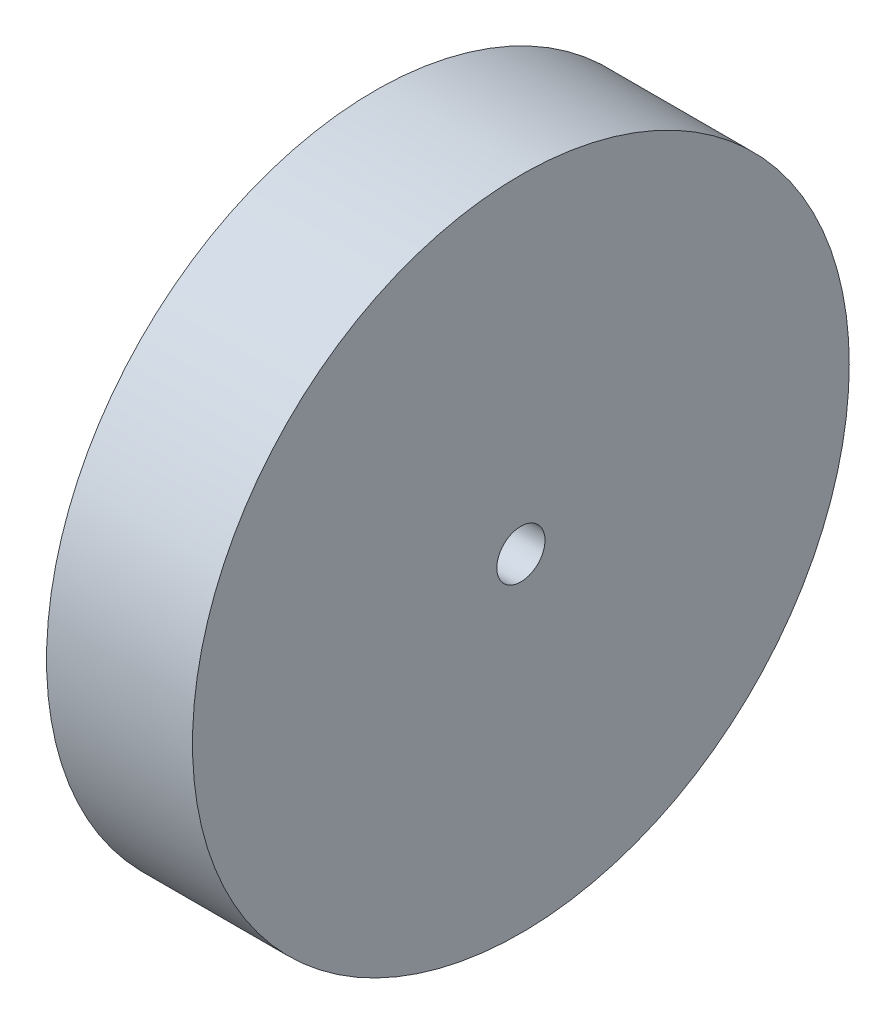
ISO-10303-21;
HEADER;
FILE_DESCRIPTION(('STEP AP214'),'2;1');
FILE_NAME('part.step','',(''),(''),'','','');
FILE_SCHEMA(('AUTOMOTIVE_DESIGN { 1 0 10303 214 1 1 1 1 }'));
ENDSEC;
DATA;
#1=APPLICATION_CONTEXT('core data for automotive mechanical design processes');
#2=APPLICATION_PROTOCOL_DEFINITION('international standard','automotive_design',2000,#1);
#3=PRODUCT_CONTEXT('',#1,'mechanical');
#4=PRODUCT('Part','Part','',(#3));
#5=PRODUCT_RELATED_PRODUCT_CATEGORY('part','',(#4));
#6=PRODUCT_DEFINITION_FORMATION('','',#4);
#7=PRODUCT_DEFINITION_CONTEXT('part definition',#1,'design');
#8=PRODUCT_DEFINITION('design','',#6,#7);
#9=PRODUCT_DEFINITION_SHAPE('','',#8);
#10=(LENGTH_UNIT() NAMED_UNIT(*) SI_UNIT(.MILLI.,.METRE.));
#11=(NAMED_UNIT(*) PLANE_ANGLE_UNIT() SI_UNIT($,.RADIAN.));
#12=(NAMED_UNIT(*) SI_UNIT($,.STERADIAN.) SOLID_ANGLE_UNIT());
#13=UNCERTAINTY_MEASURE_WITH_UNIT(LENGTH_MEASURE(1.E-05),#10,'distance_accuracy_value','');
#14=(GEOMETRIC_REPRESENTATION_CONTEXT(3) GLOBAL_UNCERTAINTY_ASSIGNED_CONTEXT((#13)) GLOBAL_UNIT_ASSIGNED_CONTEXT((#10,
#11,#12)) REPRESENTATION_CONTEXT('',''));
#15=CARTESIAN_POINT('',(0.,0.,0.));
#16=DIRECTION('',(0.,0.,1.));
#17=DIRECTION('',(1.,0.,0.));
#18=AXIS2_PLACEMENT_3D('',#15,#16,#17);
#19=CARTESIAN_POINT('',(16.9333333333333,0.,0.));
#20=DIRECTION('',(-1.,0.,0.));
#21=DIRECTION('',(0.,0.,1.));
#22=AXIS2_PLACEMENT_3D('',#19,#20,#21);
#23=CYLINDRICAL_SURFACE('',#22,38.1);
#24=CARTESIAN_POINT('',(16.9333333333333,0.,0.));
#25=DIRECTION('',(1.,0.,0.));
#26=DIRECTION('',(0.,0.,-1.));
#27=AXIS2_PLACEMENT_3D('',#24,#25,#26);
#28=CIRCLE('',#27,38.1);
#29=CARTESIAN_POINT('',(16.9333333333333,0.,-38.1));
#30=VERTEX_POINT('',#29);
#31=EDGE_CURVE('E10',#30,#30,#28,.T.);
#32=ORIENTED_EDGE('',*,*,#31,.F.);
#33=EDGE_LOOP('',(#32));
#34=FACE_BOUND('',#33,.T.);
#35=CARTESIAN_POINT('',(0.,0.,0.));
#36=DIRECTION('',(1.,0.,0.));
#37=DIRECTION('',(0.,0.,-1.));
#38=AXIS2_PLACEMENT_3D('',#35,#36,#37);
#39=CIRCLE('',#38,38.1);
#40=CARTESIAN_POINT('',(0.,0.,-38.1));
#41=VERTEX_POINT('',#40);
#42=EDGE_CURVE('E37',#41,#41,#39,.T.);
#43=ORIENTED_EDGE('',*,*,#42,.T.);
#44=EDGE_LOOP('',(#43));
#45=FACE_BOUND('',#44,.T.);
#46=ADVANCED_FACE('F34',(#34,#45),#23,.T.);
#47=CARTESIAN_POINT('',(16.9333333333333,0.,0.));
#48=DIRECTION('',(1.,0.,0.));
#49=DIRECTION('',(0.,0.,-1.));
#50=AXIS2_PLACEMENT_3D('',#47,#48,#49);
#51=PLANE('',#50);
#52=CARTESIAN_POINT('',(16.9333333333333,0.,0.));
#53=DIRECTION('',(1.,0.,0.));
#54=DIRECTION('',(0.,0.,-1.));
#55=AXIS2_PLACEMENT_3D('',#52,#53,#54);
#56=CIRCLE('',#55,2.794);
#57=CARTESIAN_POINT('',(16.9333333333333,0.,-2.794));
#58=VERTEX_POINT('',#57);
#59=EDGE_CURVE('E46',#58,#58,#56,.T.);
#60=ORIENTED_EDGE('',*,*,#59,.F.);
#61=EDGE_LOOP('',(#60));
#62=FACE_BOUND('',#61,.T.);
#63=ORIENTED_EDGE('',*,*,#31,.T.);
#64=EDGE_LOOP('',(#63));
#65=FACE_BOUND('',#64,.T.);
#66=ADVANCED_FACE('F61',(#62,#65),#51,.T.);
#67=CARTESIAN_POINT('',(0.,0.,0.));
#68=DIRECTION('',(1.,0.,0.));
#69=DIRECTION('',(0.,0.,-1.));
#70=AXIS2_PLACEMENT_3D('',#67,#68,#69);
#71=PLANE('',#70);
#72=CARTESIAN_POINT('',(0.,0.,0.));
#73=DIRECTION('',(1.,0.,0.));
#74=DIRECTION('',(0.,0.,-1.));
#75=AXIS2_PLACEMENT_3D('',#72,#73,#74);
#76=CIRCLE('',#75,2.794);
#77=CARTESIAN_POINT('',(0.,0.,-2.794));
#78=VERTEX_POINT('',#77);
#79=EDGE_CURVE('E44',#78,#78,#76,.T.);
#80=ORIENTED_EDGE('',*,*,#79,.T.);
#81=EDGE_LOOP('',(#80));
#82=FACE_BOUND('',#81,.T.);
#83=ORIENTED_EDGE('',*,*,#42,.F.);
#84=EDGE_LOOP('',(#83));
#85=FACE_BOUND('',#84,.T.);
#86=ADVANCED_FACE('F52',(#82,#85),#71,.F.);
#87=CARTESIAN_POINT('',(0.,0.,0.));
#88=DIRECTION('',(1.,0.,0.));
#89=DIRECTION('',(0.,0.,-1.));
#90=AXIS2_PLACEMENT_3D('',#87,#88,#89);
#91=CYLINDRICAL_SURFACE('',#90,2.794);
#92=ORIENTED_EDGE('',*,*,#79,.F.);
#93=EDGE_LOOP('',(#92));
#94=FACE_BOUND('',#93,.T.);
#95=ORIENTED_EDGE('',*,*,#59,.T.);
#96=EDGE_LOOP('',(#95));
#97=FACE_BOUND('',#96,.T.);
#98=ADVANCED_FACE('F55',(#94,#97),#91,.F.);
#99=CLOSED_SHELL('',(#46,#66,#86,#98));
#100=MANIFOLD_SOLID_BREP('B2',#99);
#101=ADVANCED_BREP_SHAPE_REPRESENTATION('',(#18,#100),#14);
#102=SHAPE_DEFINITION_REPRESENTATION(#9,#101);
ENDSEC;
END-ISO-10303-21;
